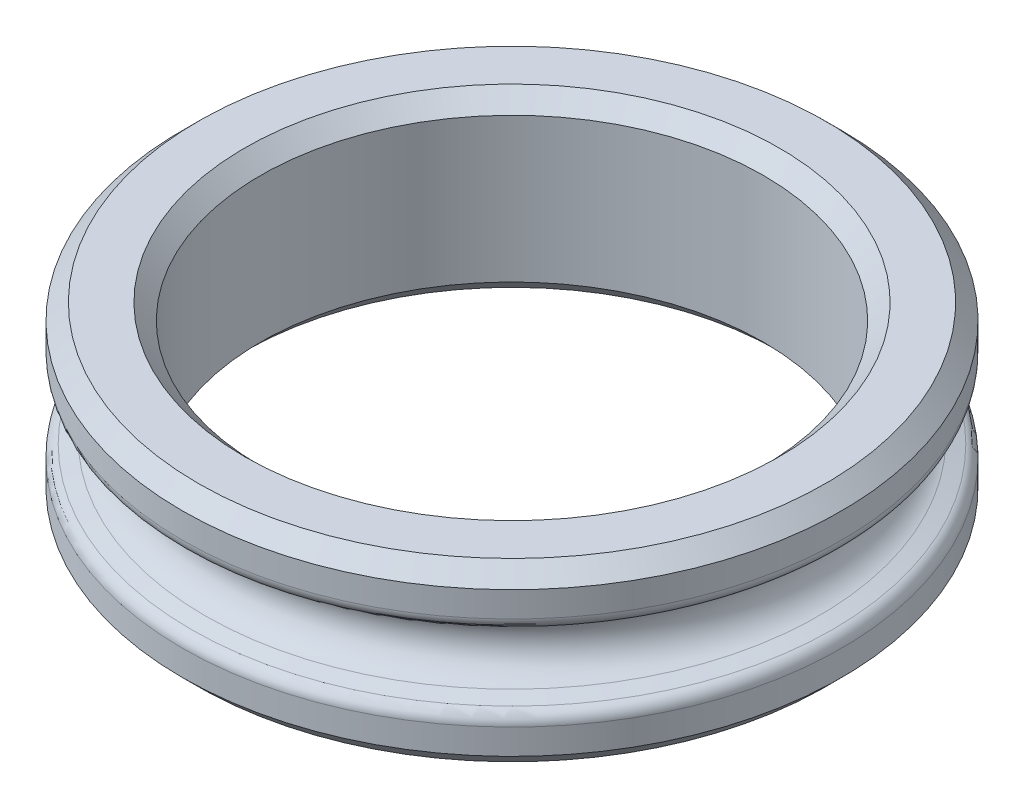
ISO-10303-21;
HEADER;
FILE_DESCRIPTION(('STEP AP214'),'2;1');
FILE_NAME('part.step','',(''),(''),'','','');
FILE_SCHEMA(('AUTOMOTIVE_DESIGN { 1 0 10303 214 1 1 1 1 }'));
ENDSEC;
DATA;
#1=APPLICATION_CONTEXT('core data for automotive mechanical design processes');
#2=APPLICATION_PROTOCOL_DEFINITION('international standard','automotive_design',2000,#1);
#3=PRODUCT_CONTEXT('',#1,'mechanical');
#4=PRODUCT('Part','Part','',(#3));
#5=PRODUCT_RELATED_PRODUCT_CATEGORY('part','',(#4));
#6=PRODUCT_DEFINITION_FORMATION('','',#4);
#7=PRODUCT_DEFINITION_CONTEXT('part definition',#1,'design');
#8=PRODUCT_DEFINITION('design','',#6,#7);
#9=PRODUCT_DEFINITION_SHAPE('','',#8);
#10=(LENGTH_UNIT() NAMED_UNIT(*) SI_UNIT(.MILLI.,.METRE.));
#11=(NAMED_UNIT(*) PLANE_ANGLE_UNIT() SI_UNIT($,.RADIAN.));
#12=(NAMED_UNIT(*) SI_UNIT($,.STERADIAN.) SOLID_ANGLE_UNIT());
#13=UNCERTAINTY_MEASURE_WITH_UNIT(LENGTH_MEASURE(1.E-05),#10,'distance_accuracy_value','');
#14=(GEOMETRIC_REPRESENTATION_CONTEXT(3) GLOBAL_UNCERTAINTY_ASSIGNED_CONTEXT((#13)) GLOBAL_UNIT_ASSIGNED_CONTEXT((#10,
#11,#12)) REPRESENTATION_CONTEXT('',''));
#15=CARTESIAN_POINT('',(0.,0.,0.));
#16=DIRECTION('',(0.,0.,1.));
#17=DIRECTION('',(1.,0.,0.));
#18=AXIS2_PLACEMENT_3D('',#15,#16,#17);
#19=CARTESIAN_POINT('',(0.,0.,0.));
#20=DIRECTION('',(0.,-1.,0.));
#21=DIRECTION('',(0.,0.,-1.));
#22=AXIS2_PLACEMENT_3D('',#19,#20,#21);
#23=CYLINDRICAL_SURFACE('',#22,5.2);
#24=CARTESIAN_POINT('',(0.,0.738144615666891,0.));
#25=DIRECTION('',(0.,1.,0.));
#26=DIRECTION('',(0.,0.,1.));
#27=AXIS2_PLACEMENT_3D('',#24,#25,#26);
#28=CIRCLE('',#27,5.2);
#29=CARTESIAN_POINT('',(0.,0.738144615666891,5.2));
#30=VERTEX_POINT('',#29);
#31=EDGE_CURVE('E45',#30,#30,#28,.T.);
#32=ORIENTED_EDGE('',*,*,#31,.T.);
#33=EDGE_LOOP('',(#32));
#34=FACE_BOUND('',#33,.T.);
#35=CARTESIAN_POINT('',(0.,1.1390625,0.));
#36=DIRECTION('',(0.,1.,0.));
#37=DIRECTION('',(0.,0.,1.));
#38=AXIS2_PLACEMENT_3D('',#35,#36,#37);
#39=CIRCLE('',#38,5.2);
#40=CARTESIAN_POINT('',(0.,1.1390625,5.2));
#41=VERTEX_POINT('',#40);
#42=EDGE_CURVE('E75',#41,#41,#39,.F.);
#43=ORIENTED_EDGE('',*,*,#42,.T.);
#44=EDGE_LOOP('',(#43));
#45=FACE_BOUND('',#44,.T.);
#46=ADVANCED_FACE('F34',(#34,#45),#23,.T.);
#47=CARTESIAN_POINT('',(0.,1.3890625,0.));
#48=DIRECTION('',(0.,1.,0.));
#49=DIRECTION('',(0.,0.,1.));
#50=AXIS2_PLACEMENT_3D('',#47,#48,#49);
#51=PLANE('',#50);
#52=CARTESIAN_POINT('',(0.,1.3890625,0.));
#53=DIRECTION('',(0.,1.,0.));
#54=DIRECTION('',(0.,0.,1.));
#55=AXIS2_PLACEMENT_3D('',#52,#53,#54);
#56=CIRCLE('',#55,4.95);
#57=CARTESIAN_POINT('',(0.,1.3890625,4.95));
#58=VERTEX_POINT('',#57);
#59=EDGE_CURVE('E69',#58,#58,#56,.T.);
#60=ORIENTED_EDGE('',*,*,#59,.T.);
#61=EDGE_LOOP('',(#60));
#62=FACE_BOUND('',#61,.T.);
#63=CARTESIAN_POINT('',(0.,1.3890625,0.));
#64=DIRECTION('',(0.,1.,0.));
#65=DIRECTION('',(0.,0.,1.));
#66=AXIS2_PLACEMENT_3D('',#63,#64,#65);
#67=CIRCLE('',#66,4.21875);
#68=CARTESIAN_POINT('',(0.,1.3890625,4.21875));
#69=VERTEX_POINT('',#68);
#70=EDGE_CURVE('E72',#69,#69,#67,.F.);
#71=ORIENTED_EDGE('',*,*,#70,.T.);
#72=EDGE_LOOP('',(#71));
#73=FACE_BOUND('',#72,.T.);
#74=ADVANCED_FACE('F103',(#62,#73),#51,.T.);
#75=CARTESIAN_POINT('',(0.,0.,0.));
#76=DIRECTION('',(0.,-1.,0.));
#77=DIRECTION('',(0.,0.,-1.));
#78=AXIS2_PLACEMENT_3D('',#75,#76,#77);
#79=CYLINDRICAL_SURFACE('',#78,3.96875);
#80=CARTESIAN_POINT('',(0.,1.1390625,0.));
#81=DIRECTION('',(0.,1.,0.));
#82=DIRECTION('',(0.,0.,1.));
#83=AXIS2_PLACEMENT_3D('',#80,#81,#82);
#84=CIRCLE('',#83,3.96875);
#85=CARTESIAN_POINT('',(0.,1.1390625,3.96875));
#86=VERTEX_POINT('',#85);
#87=EDGE_CURVE('E54',#86,#86,#84,.T.);
#88=ORIENTED_EDGE('',*,*,#87,.T.);
#89=EDGE_LOOP('',(#88));
#90=FACE_BOUND('',#89,.T.);
#91=CARTESIAN_POINT('',(0.,-1.1390625,0.));
#92=DIRECTION('',(0.,-1.,0.));
#93=DIRECTION('',(0.,0.,-1.));
#94=AXIS2_PLACEMENT_3D('',#91,#92,#93);
#95=CIRCLE('',#94,3.96875);
#96=CARTESIAN_POINT('',(0.,-1.1390625,-3.96875));
#97=VERTEX_POINT('',#96);
#98=EDGE_CURVE('E57',#97,#97,#95,.T.);
#99=ORIENTED_EDGE('',*,*,#98,.T.);
#100=EDGE_LOOP('',(#99));
#101=FACE_BOUND('',#100,.T.);
#102=ADVANCED_FACE('F109',(#90,#101),#79,.F.);
#103=CARTESIAN_POINT('',(0.,-1.3890625,0.));
#104=DIRECTION('',(0.,-1.,0.));
#105=DIRECTION('',(0.,0.,-1.));
#106=AXIS2_PLACEMENT_3D('',#103,#104,#105);
#107=PLANE('',#106);
#108=CARTESIAN_POINT('',(0.,-1.3890625,0.));
#109=DIRECTION('',(0.,-1.,0.));
#110=DIRECTION('',(0.,0.,-1.));
#111=AXIS2_PLACEMENT_3D('',#108,#109,#110);
#112=CIRCLE('',#111,4.95);
#113=CARTESIAN_POINT('',(0.,-1.3890625,-4.95));
#114=VERTEX_POINT('',#113);
#115=EDGE_CURVE('E62',#114,#114,#112,.T.);
#116=ORIENTED_EDGE('',*,*,#115,.T.);
#117=EDGE_LOOP('',(#116));
#118=FACE_BOUND('',#117,.T.);
#119=CARTESIAN_POINT('',(0.,-1.3890625,0.));
#120=DIRECTION('',(0.,-1.,0.));
#121=DIRECTION('',(0.,0.,-1.));
#122=AXIS2_PLACEMENT_3D('',#119,#120,#121);
#123=CIRCLE('',#122,4.21875000000001);
#124=CARTESIAN_POINT('',(0.,-1.3890625,-4.21875000000001));
#125=VERTEX_POINT('',#124);
#126=EDGE_CURVE('E66',#125,#125,#123,.F.);
#127=ORIENTED_EDGE('',*,*,#126,.T.);
#128=EDGE_LOOP('',(#127));
#129=FACE_BOUND('',#128,.T.);
#130=ADVANCED_FACE('F166',(#118,#129),#107,.T.);
#131=CARTESIAN_POINT('',(0.,0.,0.));
#132=DIRECTION('',(0.,-1.,0.));
#133=DIRECTION('',(0.,0.,-1.));
#134=AXIS2_PLACEMENT_3D('',#131,#132,#133);
#135=CYLINDRICAL_SURFACE('',#134,5.2);
#136=CARTESIAN_POINT('',(0.,-0.738144615666892,0.));
#137=DIRECTION('',(0.,1.,0.));
#138=DIRECTION('',(0.,0.,1.));
#139=AXIS2_PLACEMENT_3D('',#136,#137,#138);
#140=CIRCLE('',#139,5.2);
#141=CARTESIAN_POINT('',(0.,-0.738144615666892,5.2));
#142=VERTEX_POINT('',#141);
#143=EDGE_CURVE('E41',#142,#142,#140,.F.);
#144=ORIENTED_EDGE('',*,*,#143,.T.);
#145=EDGE_LOOP('',(#144));
#146=FACE_BOUND('',#145,.T.);
#147=CARTESIAN_POINT('',(0.,-1.1390625,0.));
#148=DIRECTION('',(0.,-1.,0.));
#149=DIRECTION('',(0.,0.,-1.));
#150=AXIS2_PLACEMENT_3D('',#147,#148,#149);
#151=CIRCLE('',#150,5.2);
#152=CARTESIAN_POINT('',(0.,-1.1390625,-5.2));
#153=VERTEX_POINT('',#152);
#154=EDGE_CURVE('E60',#153,#153,#151,.F.);
#155=ORIENTED_EDGE('',*,*,#154,.T.);
#156=EDGE_LOOP('',(#155));
#157=FACE_BOUND('',#156,.T.);
#158=ADVANCED_FACE('F158',(#146,#157),#135,.T.);
#159=CARTESIAN_POINT('',(0.,-0.474161827603101,0.));
#160=DIRECTION('',(0.,-1.,0.));
#161=DIRECTION('',(0.,0.,-1.));
#162=AXIS2_PLACEMENT_3D('',#159,#160,#161);
#163=CONICAL_SURFACE('',#162,4.84134767179745,1.24791041517595);
#164=CARTESIAN_POINT('',(0.,-0.548479884625652,0.));
#165=DIRECTION('',(0.,1.,0.));
#166=DIRECTION('',(0.,0.,1.));
#167=AXIS2_PLACEMENT_3D('',#164,#165,#166);
#168=CIRCLE('',#167,5.06346093128102);
#169=CARTESIAN_POINT('',(0.,-0.548479884625652,5.06346093128102));
#170=VERTEX_POINT('',#169);
#171=EDGE_CURVE('E11',#170,#170,#168,.T.);
#172=ORIENTED_EDGE('',*,*,#171,.T.);
#173=EDGE_LOOP('',(#172));
#174=FACE_BOUND('',#173,.T.);
#175=CARTESIAN_POINT('',(0.,-0.474161827603101,0.));
#176=DIRECTION('',(0.,-1.,0.));
#177=DIRECTION('',(0.,0.,-1.));
#178=AXIS2_PLACEMENT_3D('',#175,#176,#177);
#179=CIRCLE('',#178,4.84134767179745);
#180=CARTESIAN_POINT('',(0.,-0.474161827603101,-4.84134767179745));
#181=VERTEX_POINT('',#180);
#182=EDGE_CURVE('E78',#181,#181,#179,.T.);
#183=ORIENTED_EDGE('',*,*,#182,.T.);
#184=EDGE_LOOP('',(#183));
#185=FACE_BOUND('',#184,.T.);
#186=ADVANCED_FACE('F99',(#174,#185),#163,.T.);
#187=CARTESIAN_POINT('',(0.,0.,0.));
#188=DIRECTION('',(0.,-1.,0.));
#189=DIRECTION('',(0.,0.,-1.));
#190=AXIS2_PLACEMENT_3D('',#187,#188,#189);
#191=TOROIDAL_SURFACE('',#190,5.,0.5);
#192=ORIENTED_EDGE('',*,*,#182,.F.);
#193=EDGE_LOOP('',(#192));
#194=FACE_BOUND('',#193,.T.);
#195=CARTESIAN_POINT('',(0.,0.4741618276031,0.));
#196=DIRECTION('',(0.,-1.,0.));
#197=DIRECTION('',(0.,0.,-1.));
#198=AXIS2_PLACEMENT_3D('',#195,#196,#197);
#199=CIRCLE('',#198,4.84134767179745);
#200=CARTESIAN_POINT('',(0.,0.4741618276031,-4.84134767179745));
#201=VERTEX_POINT('',#200);
#202=EDGE_CURVE('E81',#201,#201,#199,.T.);
#203=ORIENTED_EDGE('',*,*,#202,.T.);
#204=EDGE_LOOP('',(#203));
#205=FACE_BOUND('',#204,.T.);
#206=ADVANCED_FACE('F85',(#194,#205),#191,.F.);
#207=CARTESIAN_POINT('',(0.,0.4741618276031,0.));
#208=DIRECTION('',(0.,1.,0.));
#209=DIRECTION('',(0.,0.,1.));
#210=AXIS2_PLACEMENT_3D('',#207,#208,#209);
#211=CONICAL_SURFACE('',#210,4.84134767179745,1.24791041517595);
#212=CARTESIAN_POINT('',(0.,0.548479884625652,0.));
#213=DIRECTION('',(0.,-1.,0.));
#214=DIRECTION('',(0.,0.,-1.));
#215=AXIS2_PLACEMENT_3D('',#212,#213,#214);
#216=CIRCLE('',#215,5.06346093128102);
#217=CARTESIAN_POINT('',(0.,0.548479884625652,-5.06346093128102));
#218=VERTEX_POINT('',#217);
#219=EDGE_CURVE('E49',#218,#218,#216,.T.);
#220=ORIENTED_EDGE('',*,*,#219,.T.);
#221=EDGE_LOOP('',(#220));
#222=FACE_BOUND('',#221,.T.);
#223=ORIENTED_EDGE('',*,*,#202,.F.);
#224=EDGE_LOOP('',(#223));
#225=FACE_BOUND('',#224,.T.);
#226=ADVANCED_FACE('F87',(#222,#225),#211,.T.);
#227=CARTESIAN_POINT('',(0.,1.1390625,0.));
#228=DIRECTION('',(0.,-1.,0.));
#229=DIRECTION('',(0.,0.,-1.));
#230=AXIS2_PLACEMENT_3D('',#227,#228,#229);
#231=CONICAL_SURFACE('',#230,5.2,0.785398163397452);
#232=ORIENTED_EDGE('',*,*,#59,.F.);
#233=EDGE_LOOP('',(#232));
#234=FACE_BOUND('',#233,.T.);
#235=ORIENTED_EDGE('',*,*,#42,.F.);
#236=EDGE_LOOP('',(#235));
#237=FACE_BOUND('',#236,.T.);
#238=ADVANCED_FACE('F89',(#234,#237),#231,.T.);
#239=CARTESIAN_POINT('',(0.,-1.3890625,0.));
#240=DIRECTION('',(0.,1.,0.));
#241=DIRECTION('',(0.,0.,1.));
#242=AXIS2_PLACEMENT_3D('',#239,#240,#241);
#243=CONICAL_SURFACE('',#242,4.95,0.785398163397447);
#244=ORIENTED_EDGE('',*,*,#154,.F.);
#245=EDGE_LOOP('',(#244));
#246=FACE_BOUND('',#245,.T.);
#247=ORIENTED_EDGE('',*,*,#115,.F.);
#248=EDGE_LOOP('',(#247));
#249=FACE_BOUND('',#248,.T.);
#250=ADVANCED_FACE('F96',(#246,#249),#243,.T.);
#251=CARTESIAN_POINT('',(0.,1.3890625,0.));
#252=DIRECTION('',(0.,1.,0.));
#253=DIRECTION('',(0.,0.,1.));
#254=AXIS2_PLACEMENT_3D('',#251,#252,#253);
#255=CONICAL_SURFACE('',#254,4.21875,0.785398163397447);
#256=ORIENTED_EDGE('',*,*,#87,.F.);
#257=EDGE_LOOP('',(#256));
#258=FACE_BOUND('',#257,.T.);
#259=ORIENTED_EDGE('',*,*,#70,.F.);
#260=EDGE_LOOP('',(#259));
#261=FACE_BOUND('',#260,.T.);
#262=ADVANCED_FACE('F117',(#258,#261),#255,.F.);
#263=CARTESIAN_POINT('',(0.,-1.1390625,0.));
#264=DIRECTION('',(0.,-1.,0.));
#265=DIRECTION('',(0.,0.,-1.));
#266=AXIS2_PLACEMENT_3D('',#263,#264,#265);
#267=CONICAL_SURFACE('',#266,3.96875,0.785398163397452);
#268=ORIENTED_EDGE('',*,*,#126,.F.);
#269=EDGE_LOOP('',(#268));
#270=FACE_BOUND('',#269,.T.);
#271=ORIENTED_EDGE('',*,*,#98,.F.);
#272=EDGE_LOOP('',(#271));
#273=FACE_BOUND('',#272,.T.);
#274=ADVANCED_FACE('F121',(#270,#273),#267,.F.);
#275=CARTESIAN_POINT('',(0.,0.738144615666891,0.));
#276=DIRECTION('',(0.,1.,0.));
#277=DIRECTION('',(0.,0.,1.));
#278=AXIS2_PLACEMENT_3D('',#275,#276,#277);
#279=TOROIDAL_SURFACE('',#278,5.,0.2);
#280=ORIENTED_EDGE('',*,*,#31,.F.);
#281=EDGE_LOOP('',(#280));
#282=FACE_BOUND('',#281,.T.);
#283=ORIENTED_EDGE('',*,*,#219,.F.);
#284=EDGE_LOOP('',(#283));
#285=FACE_BOUND('',#284,.T.);
#286=ADVANCED_FACE('F124',(#282,#285),#279,.T.);
#287=CARTESIAN_POINT('',(0.,-0.738144615666892,0.));
#288=DIRECTION('',(0.,1.,0.));
#289=DIRECTION('',(0.,0.,1.));
#290=AXIS2_PLACEMENT_3D('',#287,#288,#289);
#291=TOROIDAL_SURFACE('',#290,5.,0.2);
#292=ORIENTED_EDGE('',*,*,#171,.F.);
#293=EDGE_LOOP('',(#292));
#294=FACE_BOUND('',#293,.T.);
#295=ORIENTED_EDGE('',*,*,#143,.F.);
#296=EDGE_LOOP('',(#295));
#297=FACE_BOUND('',#296,.T.);
#298=ADVANCED_FACE('F36',(#294,#297),#291,.T.);
#299=CLOSED_SHELL('',(#46,#74,#102,#130,#158,#186,#206,#226,#238,#250,#262,#274,#286,#298));
#300=MANIFOLD_SOLID_BREP('B2',#299);
#301=ADVANCED_BREP_SHAPE_REPRESENTATION('',(#18,#300),#14);
#302=SHAPE_DEFINITION_REPRESENTATION(#9,#301);
ENDSEC;
END-ISO-10303-21;
